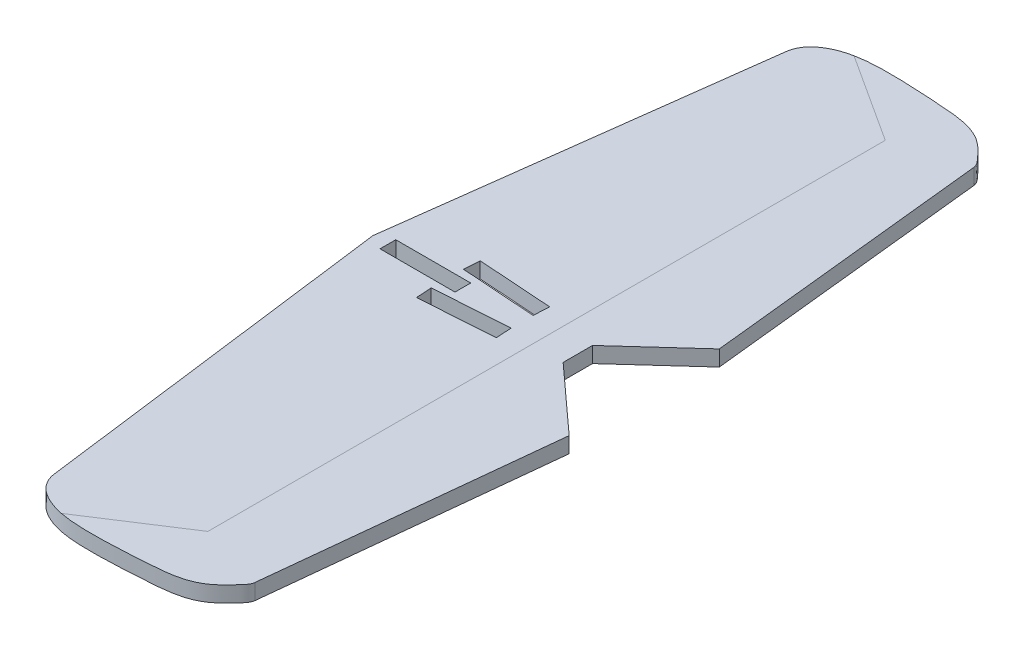
ISO-10303-21;
HEADER;
FILE_DESCRIPTION(('STEP AP214'),'2;1');
FILE_NAME('part.step','',(''),(''),'','','');
FILE_SCHEMA(('AUTOMOTIVE_DESIGN { 1 0 10303 214 1 1 1 1 }'));
ENDSEC;
DATA;
#1=APPLICATION_CONTEXT('core data for automotive mechanical design processes');
#2=APPLICATION_PROTOCOL_DEFINITION('international standard','automotive_design',2000,#1);
#3=PRODUCT_CONTEXT('',#1,'mechanical');
#4=PRODUCT('Part','Part','',(#3));
#5=PRODUCT_RELATED_PRODUCT_CATEGORY('part','',(#4));
#6=PRODUCT_DEFINITION_FORMATION('','',#4);
#7=PRODUCT_DEFINITION_CONTEXT('part definition',#1,'design');
#8=PRODUCT_DEFINITION('design','',#6,#7);
#9=PRODUCT_DEFINITION_SHAPE('','',#8);
#10=(LENGTH_UNIT() NAMED_UNIT(*) SI_UNIT(.MILLI.,.METRE.));
#11=(NAMED_UNIT(*) PLANE_ANGLE_UNIT() SI_UNIT($,.RADIAN.));
#12=(NAMED_UNIT(*) SI_UNIT($,.STERADIAN.) SOLID_ANGLE_UNIT());
#13=UNCERTAINTY_MEASURE_WITH_UNIT(LENGTH_MEASURE(1.E-05),#10,'distance_accuracy_value','');
#14=(GEOMETRIC_REPRESENTATION_CONTEXT(3) GLOBAL_UNCERTAINTY_ASSIGNED_CONTEXT((#13)) GLOBAL_UNIT_ASSIGNED_CONTEXT((#10,
#11,#12)) REPRESENTATION_CONTEXT('',''));
#15=CARTESIAN_POINT('',(0.,0.,0.));
#16=DIRECTION('',(0.,0.,1.));
#17=DIRECTION('',(1.,0.,0.));
#18=AXIS2_PLACEMENT_3D('',#15,#16,#17);
#19=CARTESIAN_POINT('',(0.,5.334,0.));
#20=DIRECTION('',(0.,1.,0.));
#21=DIRECTION('',(0.,0.,1.));
#22=AXIS2_PLACEMENT_3D('',#19,#20,#21);
#23=PLANE('',#22);
#24=DIRECTION('',(0.,0.,-1.));
#25=VECTOR('',#24,1.);
#26=CARTESIAN_POINT('',(30.48,5.334,2.667));
#27=LINE('',#26,#25);
#28=CARTESIAN_POINT('',(30.48,5.334,2.667));
#29=VERTEX_POINT('',#28);
#30=CARTESIAN_POINT('',(30.48,5.334,-2.667));
#31=VERTEX_POINT('',#30);
#32=EDGE_CURVE('E55',#29,#31,#27,.T.);
#33=ORIENTED_EDGE('',*,*,#32,.F.);
#34=DIRECTION('',(1.,0.,0.));
#35=VECTOR('',#34,1.);
#36=CARTESIAN_POINT('',(5.08,5.334,2.667));
#37=LINE('',#36,#35);
#38=CARTESIAN_POINT('',(5.08,5.334,2.667));
#39=VERTEX_POINT('',#38);
#40=EDGE_CURVE('E202',#39,#29,#37,.T.);
#41=ORIENTED_EDGE('',*,*,#40,.F.);
#42=DIRECTION('',(0.,0.,1.));
#43=VECTOR('',#42,1.);
#44=CARTESIAN_POINT('',(5.08,5.334,2.667));
#45=LINE('',#44,#43);
#46=CARTESIAN_POINT('',(5.08,5.334,-2.667));
#47=VERTEX_POINT('',#46);
#48=EDGE_CURVE('E222',#47,#39,#45,.T.);
#49=ORIENTED_EDGE('',*,*,#48,.F.);
#50=DIRECTION('',(-1.,0.,0.));
#51=VECTOR('',#50,1.);
#52=CARTESIAN_POINT('',(5.08,5.334,-2.667));
#53=LINE('',#52,#51);
#54=EDGE_CURVE('E216',#31,#47,#53,.T.);
#55=ORIENTED_EDGE('',*,*,#54,.F.);
#56=EDGE_LOOP('',(#33,#41,#49,#55));
#57=FACE_BOUND('',#56,.T.);
#58=DIRECTION('',(0.0687869822485303,0.,0.997631370333321));
#59=VECTOR('',#58,1.);
#60=CARTESIAN_POINT('',(25.2047798613313,5.334,5.47048980785622));
#61=LINE('',#60,#59);
#62=CARTESIAN_POINT('',(25.2047798613313,5.334,5.47048980785622));
#63=VERTEX_POINT('',#62);
#64=CARTESIAN_POINT('',(25.571689624645,5.334,10.7918555372142));
#65=VERTEX_POINT('',#64);
#66=EDGE_CURVE('E238',#63,#65,#61,.T.);
#67=ORIENTED_EDGE('',*,*,#66,.F.);
#68=DIRECTION('',(-0.997631370333322,0.,0.0687869822485204));
#69=VECTOR('',#68,1.);
#70=CARTESIAN_POINT('',(50.5446166677977,5.334,3.7233004587438));
#71=LINE('',#70,#69);
#72=CARTESIAN_POINT('',(50.5446166677977,5.334,3.7233004587438));
#73=VERTEX_POINT('',#72);
#74=EDGE_CURVE('E246',#73,#63,#71,.T.);
#75=ORIENTED_EDGE('',*,*,#74,.F.);
#76=DIRECTION('',(-0.0687869822485303,0.,-0.997631370333321));
#77=VECTOR('',#76,1.);
#78=CARTESIAN_POINT('',(50.9115264311114,5.334,9.04466618810174));
#79=LINE('',#78,#77);
#80=CARTESIAN_POINT('',(50.9115264311114,5.334,9.04466618810174));
#81=VERTEX_POINT('',#80);
#82=EDGE_CURVE('E243',#81,#73,#79,.T.);
#83=ORIENTED_EDGE('',*,*,#82,.F.);
#84=DIRECTION('',(0.997631370333322,0.,-0.0687869822485205));
#85=VECTOR('',#84,1.);
#86=CARTESIAN_POINT('',(25.571689624645,5.334,10.7918555372142));
#87=LINE('',#86,#85);
#88=EDGE_CURVE('E240',#65,#81,#87,.T.);
#89=ORIENTED_EDGE('',*,*,#88,.F.);
#90=EDGE_LOOP('',(#67,#75,#83,#89));
#91=FACE_BOUND('',#90,.T.);
#92=DIRECTION('',(0.0687869822485303,0.,-0.997631370333321));
#93=VECTOR('',#92,1.);
#94=CARTESIAN_POINT('',(50.5446166677977,5.334,-3.72330045874381));
#95=LINE('',#94,#93);
#96=CARTESIAN_POINT('',(50.5446166677977,5.334,-3.72330045874381));
#97=VERTEX_POINT('',#96);
#98=CARTESIAN_POINT('',(50.9115264311114,5.334,-9.04466618810174));
#99=VERTEX_POINT('',#98);
#100=EDGE_CURVE('E269',#97,#99,#95,.T.);
#101=ORIENTED_EDGE('',*,*,#100,.F.);
#102=DIRECTION('',(0.997631370333322,0.,0.0687869822485204));
#103=VECTOR('',#102,1.);
#104=CARTESIAN_POINT('',(25.2047798613313,5.334,-5.47048980785623));
#105=LINE('',#104,#103);
#106=CARTESIAN_POINT('',(25.2047798613313,5.334,-5.47048980785623));
#107=VERTEX_POINT('',#106);
#108=EDGE_CURVE('E277',#107,#97,#105,.T.);
#109=ORIENTED_EDGE('',*,*,#108,.F.);
#110=DIRECTION('',(-0.0687869822485303,0.,0.997631370333321));
#111=VECTOR('',#110,1.);
#112=CARTESIAN_POINT('',(25.571689624645,5.334,-10.7918555372142));
#113=LINE('',#112,#111);
#114=CARTESIAN_POINT('',(25.571689624645,5.334,-10.7918555372142));
#115=VERTEX_POINT('',#114);
#116=EDGE_CURVE('E274',#115,#107,#113,.T.);
#117=ORIENTED_EDGE('',*,*,#116,.F.);
#118=DIRECTION('',(-0.997631370333322,0.,-0.0687869822485204));
#119=VECTOR('',#118,1.);
#120=CARTESIAN_POINT('',(50.9115264311114,5.334,-9.04466618810174));
#121=LINE('',#120,#119);
#122=EDGE_CURVE('E271',#99,#115,#121,.T.);
#123=ORIENTED_EDGE('',*,*,#122,.F.);
#124=EDGE_LOOP('',(#101,#109,#117,#123));
#125=FACE_BOUND('',#124,.T.);
#126=DIRECTION('',(0.,0.,-1.));
#127=VECTOR('',#126,1.);
#128=CARTESIAN_POINT('',(58.8561371925111,5.334,0.));
#129=LINE('',#128,#127);
#130=CARTESIAN_POINT('',(58.8561371925111,5.334,114.78665798769));
#131=VERTEX_POINT('',#130);
#132=CARTESIAN_POINT('',(58.8561371925111,5.334,-114.78665798769));
#133=VERTEX_POINT('',#132);
#134=EDGE_CURVE('E48',#131,#133,#129,.T.);
#135=ORIENTED_EDGE('',*,*,#134,.T.);
#136=DIRECTION('',(-0.83910232786527,0.,-0.543973605399274));
#137=VECTOR('',#136,1.);
#138=CARTESIAN_POINT('',(69.8102744451348,5.334,-107.685305342766));
#139=LINE('',#138,#137);
#140=CARTESIAN_POINT('',(28.7278859954556,5.334,-134.318213179973));
#141=VERTEX_POINT('',#140);
#142=EDGE_CURVE('E11',#133,#141,#139,.T.);
#143=ORIENTED_EDGE('',*,*,#142,.T.);
#144=CARTESIAN_POINT('',(15.9702164979944,5.334,-123.888067637132));
#145=CARTESIAN_POINT('',(16.4963487927457,5.334,-127.969509696882));
#146=CARTESIAN_POINT('',(23.1266573834124,5.334,-134.082989783868));
#147=CARTESIAN_POINT('',(33.9982040420756,5.334,-135.216803509659));
#148=CARTESIAN_POINT('',(46.0547082745857,5.334,-135.14509413231));
#149=CARTESIAN_POINT('',(57.8788575886376,5.334,-134.457454778396));
#150=CARTESIAN_POINT('',(71.9865891268067,5.334,-133.257487145702));
#151=CARTESIAN_POINT('',(78.6192928755792,5.334,-126.558567530121));
#152=CARTESIAN_POINT('',(81.6818469453373,5.334,-123.009151118355));
#153=CARTESIAN_POINT('',(81.8050974666888,5.334,-121.838331349505));
#154=B_SPLINE_CURVE_WITH_KNOTS('',3,(#144,#145,#146,#147,#148,#149,#150,#151,#152,#153),
.UNSPECIFIED.,.F.,.F.,(4,1,1,1,1,1,1,4),(0.,0.137873604608299,0.340707260866682,
0.419473128803028,0.623495843735745,0.825009794656915,0.952423895278866,1.),.UNSPECIFIED.);
#155=CARTESIAN_POINT('',(15.9702164979944,5.334,-123.888067637132));
#156=VERTEX_POINT('',#155);
#157=EDGE_CURVE('E316',#156,#141,#154,.T.);
#158=ORIENTED_EDGE('',*,*,#157,.F.);
#159=DIRECTION('',(0.127850537666377,0.,-0.991793446246958));
#160=VECTOR('',#159,1.);
#161=CARTESIAN_POINT('',(0.,5.334,0.));
#162=LINE('',#161,#160);
#163=CARTESIAN_POINT('',(0.,5.334,0.));
#164=VERTEX_POINT('',#163);
#165=EDGE_CURVE('E322',#164,#156,#162,.T.);
#166=ORIENTED_EDGE('',*,*,#165,.F.);
#167=DIRECTION('',(0.127850537666377,0.,0.991793446246958));
#168=VECTOR('',#167,1.);
#169=CARTESIAN_POINT('',(0.,5.334,0.));
#170=LINE('',#169,#168);
#171=CARTESIAN_POINT('',(15.9702164979944,5.334,123.888067637132));
#172=VERTEX_POINT('',#171);
#173=EDGE_CURVE('E409',#164,#172,#170,.T.);
#174=ORIENTED_EDGE('',*,*,#173,.T.);
#175=CARTESIAN_POINT('',(15.9702164979944,5.334,123.888067637132));
#176=CARTESIAN_POINT('',(16.4963487927457,5.334,127.969509696882));
#177=CARTESIAN_POINT('',(23.1266573834124,5.334,134.082989783868));
#178=CARTESIAN_POINT('',(33.9982040420756,5.334,135.216803509659));
#179=CARTESIAN_POINT('',(46.0547082745857,5.334,135.14509413231));
#180=CARTESIAN_POINT('',(57.8788575886376,5.334,134.457454778396));
#181=CARTESIAN_POINT('',(71.9865891268067,5.334,133.257487145702));
#182=CARTESIAN_POINT('',(78.6192928755792,5.334,126.558567530121));
#183=CARTESIAN_POINT('',(81.6818469453373,5.334,123.009151118355));
#184=CARTESIAN_POINT('',(81.8050974666888,5.334,121.838331349505));
#185=B_SPLINE_CURVE_WITH_KNOTS('',3,(#175,#176,#177,#178,#179,#180,#181,#182,#183,#184),
.UNSPECIFIED.,.F.,.F.,(4,1,1,1,1,1,1,4),(0.,0.137873604608299,0.340707260866682,
0.419473128803028,0.623495843735745,0.825009794656915,0.952423895278866,1.),.UNSPECIFIED.);
#186=CARTESIAN_POINT('',(28.7278859954557,5.334,134.318213179973));
#187=VERTEX_POINT('',#186);
#188=EDGE_CURVE('E292',#172,#187,#185,.T.);
#189=ORIENTED_EDGE('',*,*,#188,.T.);
#190=DIRECTION('',(0.83910232786527,0.,-0.543973605399274));
#191=VECTOR('',#190,1.);
#192=CARTESIAN_POINT('',(69.8102744451348,5.334,107.685305342766));
#193=LINE('',#192,#191);
#194=EDGE_CURVE('E381',#187,#131,#193,.T.);
#195=ORIENTED_EDGE('',*,*,#194,.T.);
#196=EDGE_LOOP('',(#135,#143,#158,#166,#174,#189,#195));
#197=FACE_BOUND('',#196,.T.);
#198=ADVANCED_FACE('F38',(#57,#91,#125,#197),#23,.T.);
#199=DIRECTION('',(0.,-1.,0.));
#200=VECTOR('',#199,1.);
#201=SURFACE_OF_LINEAR_EXTRUSION('',#185,#200);
#202=CARTESIAN_POINT('',(15.9702164979944,0.,123.888067637132));
#203=CARTESIAN_POINT('',(16.4963487927457,0.,127.969509696882));
#204=CARTESIAN_POINT('',(23.1266573834124,0.,134.082989783868));
#205=CARTESIAN_POINT('',(33.9982040420756,0.,135.216803509659));
#206=CARTESIAN_POINT('',(46.0547082745857,0.,135.14509413231));
#207=CARTESIAN_POINT('',(57.8788575886376,0.,134.457454778396));
#208=CARTESIAN_POINT('',(71.9865891268067,0.,133.257487145702));
#209=CARTESIAN_POINT('',(78.6192928755792,0.,126.558567530121));
#210=CARTESIAN_POINT('',(81.6818469453373,0.,123.009151118355));
#211=CARTESIAN_POINT('',(81.8050974666888,0.,121.838331349505));
#212=B_SPLINE_CURVE_WITH_KNOTS('',3,(#202,#203,#204,#205,#206,#207,#208,#209,#210,#211),
.UNSPECIFIED.,.F.,.F.,(4,1,1,1,1,1,1,4),(0.,0.137873604608299,0.340707260866682,
0.419473128803028,0.623495843735745,0.825009794656915,0.952423895278866,1.),.UNSPECIFIED.);
#213=CARTESIAN_POINT('',(15.9702164979944,0.,123.888067637132));
#214=VERTEX_POINT('',#213);
#215=CARTESIAN_POINT('',(81.8050974666888,0.,121.838331349505));
#216=VERTEX_POINT('',#215);
#217=EDGE_CURVE('E291',#214,#216,#212,.T.);
#218=ORIENTED_EDGE('',*,*,#217,.T.);
#219=DIRECTION('',(0.,-1.,0.));
#220=VECTOR('',#219,1.);
#221=CARTESIAN_POINT('',(81.8050974666888,5.334,121.838331349505));
#222=LINE('',#221,#220);
#223=CARTESIAN_POINT('',(81.8050974666888,5.334,121.838331349505));
#224=VERTEX_POINT('',#223);
#225=EDGE_CURVE('E386',#224,#216,#222,.T.);
#226=ORIENTED_EDGE('',*,*,#225,.F.);
#227=EDGE_CURVE('E299',#187,#224,#185,.T.);
#228=ORIENTED_EDGE('',*,*,#227,.F.);
#229=ORIENTED_EDGE('',*,*,#188,.F.);
#230=DIRECTION('',(0.,-1.,0.));
#231=VECTOR('',#230,1.);
#232=CARTESIAN_POINT('',(15.9702164979944,5.334,123.888067637132));
#233=LINE('',#232,#231);
#234=EDGE_CURVE('E406',#172,#214,#233,.T.);
#235=ORIENTED_EDGE('',*,*,#234,.T.);
#236=EDGE_LOOP('',(#218,#226,#228,#229,#235));
#237=FACE_BOUND('',#236,.T.);
#238=ADVANCED_FACE('F40',(#237),#201,.F.);
#239=CARTESIAN_POINT('',(93.5936884313565,5.334,9.85247362684192));
#240=DIRECTION('',(-0.994504892678948,0.,-0.104690106684607));
#241=DIRECTION('',(-0.104690106684607,0.,0.994504892678948));
#242=AXIS2_PLACEMENT_3D('',#239,#240,#241);
#243=PLANE('',#242);
#244=DIRECTION('',(0.104690106684607,0.,-0.994504892678948));
#245=VECTOR('',#244,1.);
#246=CARTESIAN_POINT('',(93.5936884313565,0.,9.85247362684192));
#247=LINE('',#246,#245);
#248=CARTESIAN_POINT('',(91.9525715057503,0.,25.4422830525839));
#249=VERTEX_POINT('',#248);
#250=EDGE_CURVE('E435',#216,#249,#247,.T.);
#251=ORIENTED_EDGE('',*,*,#250,.T.);
#252=DIRECTION('',(0.,-1.,0.));
#253=VECTOR('',#252,1.);
#254=CARTESIAN_POINT('',(91.9525715057503,5.334,25.4422830525839));
#255=LINE('',#254,#253);
#256=CARTESIAN_POINT('',(91.9525715057503,5.334,25.4422830525839));
#257=VERTEX_POINT('',#256);
#258=EDGE_CURVE('E391',#257,#249,#255,.T.);
#259=ORIENTED_EDGE('',*,*,#258,.F.);
#260=DIRECTION('',(0.104690106684607,0.,-0.994504892678948));
#261=VECTOR('',#260,1.);
#262=CARTESIAN_POINT('',(93.5936884313565,5.334,9.85247362684192));
#263=LINE('',#262,#261);
#264=EDGE_CURVE('E298',#224,#257,#263,.T.);
#265=ORIENTED_EDGE('',*,*,#264,.F.);
#266=ORIENTED_EDGE('',*,*,#225,.T.);
#267=EDGE_LOOP('',(#251,#259,#265,#266));
#268=FACE_BOUND('',#267,.T.);
#269=ADVANCED_FACE('F349',(#268),#243,.F.);
#270=CARTESIAN_POINT('',(28.9439186189584,5.334,-31.8383104808575));
#271=DIRECTION('',(-0.672672793996275,0.,0.739940073395978));
#272=DIRECTION('',(0.739940073395978,0.,0.672672793996275));
#273=AXIS2_PLACEMENT_3D('',#270,#271,#272);
#274=PLANE('',#273);
#275=DIRECTION('',(-0.739940073395978,0.,-0.672672793996275));
#276=VECTOR('',#275,1.);
#277=CARTESIAN_POINT('',(28.9439186189584,0.,-31.8383104808575));
#278=LINE('',#277,#276);
#279=CARTESIAN_POINT('',(69.4478620140546,0.,4.98345624195347));
#280=VERTEX_POINT('',#279);
#281=EDGE_CURVE('E432',#249,#280,#278,.T.);
#282=ORIENTED_EDGE('',*,*,#281,.T.);
#283=DIRECTION('',(0.,-1.,0.));
#284=VECTOR('',#283,1.);
#285=CARTESIAN_POINT('',(69.4478620140546,5.334,4.98345624195347));
#286=LINE('',#285,#284);
#287=CARTESIAN_POINT('',(69.4478620140546,5.334,4.98345624195347));
#288=VERTEX_POINT('',#287);
#289=EDGE_CURVE('E394',#288,#280,#286,.T.);
#290=ORIENTED_EDGE('',*,*,#289,.F.);
#291=DIRECTION('',(-0.739940073395978,0.,-0.672672793996275));
#292=VECTOR('',#291,1.);
#293=CARTESIAN_POINT('',(28.9439186189584,5.334,-31.8383104808575));
#294=LINE('',#293,#292);
#295=EDGE_CURVE('E304',#257,#288,#294,.T.);
#296=ORIENTED_EDGE('',*,*,#295,.F.);
#297=ORIENTED_EDGE('',*,*,#258,.T.);
#298=EDGE_LOOP('',(#282,#290,#296,#297));
#299=FACE_BOUND('',#298,.T.);
#300=ADVANCED_FACE('F346',(#299),#274,.F.);
#301=CARTESIAN_POINT('',(69.4478620140559,5.334,1.9436342152399E-11));
#302=DIRECTION('',(1.,0.,2.79869553773523E-13));
#303=DIRECTION('',(2.79869553773523E-13,0.,-1.));
#304=AXIS2_PLACEMENT_3D('',#301,#302,#303);
#305=PLANE('',#304);
#306=DIRECTION('',(-2.79869553773523E-13,0.,1.));
#307=VECTOR('',#306,1.);
#308=CARTESIAN_POINT('',(69.4478620140559,0.,1.9436342152399E-11));
#309=LINE('',#308,#307);
#310=CARTESIAN_POINT('',(69.4478620140573,0.,-4.98345624195318));
#311=VERTEX_POINT('',#310);
#312=EDGE_CURVE('E429',#311,#280,#309,.T.);
#313=ORIENTED_EDGE('',*,*,#312,.F.);
#314=DIRECTION('',(0.,-1.,0.));
#315=VECTOR('',#314,1.);
#316=CARTESIAN_POINT('',(69.4478620140573,5.334,-4.98345624195318));
#317=LINE('',#316,#315);
#318=CARTESIAN_POINT('',(69.4478620140573,5.334,-4.98345624195318));
#319=VERTEX_POINT('',#318);
#320=EDGE_CURVE('E396',#319,#311,#317,.T.);
#321=ORIENTED_EDGE('',*,*,#320,.F.);
#322=DIRECTION('',(-2.79869553773523E-13,0.,1.));
#323=VECTOR('',#322,1.);
#324=CARTESIAN_POINT('',(69.4478620140559,5.334,1.9436342152399E-11));
#325=LINE('',#324,#323);
#326=EDGE_CURVE('E306',#319,#288,#325,.T.);
#327=ORIENTED_EDGE('',*,*,#326,.T.);
#328=ORIENTED_EDGE('',*,*,#289,.T.);
#329=EDGE_LOOP('',(#313,#321,#327,#328));
#330=FACE_BOUND('',#329,.T.);
#331=ADVANCED_FACE('F342',(#330),#305,.T.);
#332=CARTESIAN_POINT('',(28.9439186189614,5.334,31.8383104808593));
#333=DIRECTION('',(0.672672793996293,0.,0.739940073395962));
#334=DIRECTION('',(0.739940073395962,0.,-0.672672793996293));
#335=AXIS2_PLACEMENT_3D('',#332,#333,#334);
#336=PLANE('',#335);
#337=DIRECTION('',(-0.739940073395962,0.,0.672672793996293));
#338=VECTOR('',#337,1.);
#339=CARTESIAN_POINT('',(28.9439186189614,0.,31.8383104808593));
#340=LINE('',#339,#338);
#341=CARTESIAN_POINT('',(91.9525715057526,0.,-25.4422830525841));
#342=VERTEX_POINT('',#341);
#343=EDGE_CURVE('E426',#342,#311,#340,.T.);
#344=ORIENTED_EDGE('',*,*,#343,.F.);
#345=DIRECTION('',(0.,-1.,0.));
#346=VECTOR('',#345,1.);
#347=CARTESIAN_POINT('',(91.9525715057526,5.334,-25.4422830525841));
#348=LINE('',#347,#346);
#349=CARTESIAN_POINT('',(91.9525715057526,5.334,-25.4422830525841));
#350=VERTEX_POINT('',#349);
#351=EDGE_CURVE('E398',#350,#342,#348,.T.);
#352=ORIENTED_EDGE('',*,*,#351,.F.);
#353=DIRECTION('',(-0.739940073395962,0.,0.672672793996293));
#354=VECTOR('',#353,1.);
#355=CARTESIAN_POINT('',(28.9439186189614,5.334,31.8383104808593));
#356=LINE('',#355,#354);
#357=EDGE_CURVE('E309',#350,#319,#356,.T.);
#358=ORIENTED_EDGE('',*,*,#357,.T.);
#359=ORIENTED_EDGE('',*,*,#320,.T.);
#360=EDGE_LOOP('',(#344,#352,#358,#359));
#361=FACE_BOUND('',#360,.T.);
#362=ADVANCED_FACE('F338',(#361),#336,.T.);
#363=CARTESIAN_POINT('',(93.5936884313589,5.334,-9.85247362684443));
#364=DIRECTION('',(0.994504892678945,0.,-0.104690106684631));
#365=DIRECTION('',(-0.104690106684631,0.,-0.994504892678945));
#366=AXIS2_PLACEMENT_3D('',#363,#364,#365);
#367=PLANE('',#366);
#368=DIRECTION('',(0.104690106684631,0.,0.994504892678945));
#369=VECTOR('',#368,1.);
#370=CARTESIAN_POINT('',(93.5936884313589,0.,-9.85247362684443));
#371=LINE('',#370,#369);
#372=CARTESIAN_POINT('',(81.8050974666888,0.,-121.838331349505));
#373=VERTEX_POINT('',#372);
#374=EDGE_CURVE('E420',#373,#342,#371,.T.);
#375=ORIENTED_EDGE('',*,*,#374,.F.);
#376=DIRECTION('',(0.,-1.,0.));
#377=VECTOR('',#376,1.);
#378=CARTESIAN_POINT('',(81.8050974666888,5.334,-121.838331349505));
#379=LINE('',#378,#377);
#380=CARTESIAN_POINT('',(81.8050974666888,5.334,-121.838331349505));
#381=VERTEX_POINT('',#380);
#382=EDGE_CURVE('E400',#381,#373,#379,.T.);
#383=ORIENTED_EDGE('',*,*,#382,.F.);
#384=DIRECTION('',(0.104690106684631,0.,0.994504892678945));
#385=VECTOR('',#384,1.);
#386=CARTESIAN_POINT('',(93.5936884313589,5.334,-9.85247362684443));
#387=LINE('',#386,#385);
#388=EDGE_CURVE('E312',#381,#350,#387,.T.);
#389=ORIENTED_EDGE('',*,*,#388,.T.);
#390=ORIENTED_EDGE('',*,*,#351,.T.);
#391=EDGE_LOOP('',(#375,#383,#389,#390));
#392=FACE_BOUND('',#391,.T.);
#393=ADVANCED_FACE('F333',(#392),#367,.T.);
#394=DIRECTION('',(0.,-1.,0.));
#395=VECTOR('',#394,1.);
#396=SURFACE_OF_LINEAR_EXTRUSION('',#154,#395);
#397=CARTESIAN_POINT('',(15.9702164979944,0.,-123.888067637132));
#398=CARTESIAN_POINT('',(16.4963487927457,0.,-127.969509696882));
#399=CARTESIAN_POINT('',(23.1266573834124,0.,-134.082989783868));
#400=CARTESIAN_POINT('',(33.9982040420756,0.,-135.216803509659));
#401=CARTESIAN_POINT('',(46.0547082745857,0.,-135.14509413231));
#402=CARTESIAN_POINT('',(57.8788575886376,0.,-134.457454778396));
#403=CARTESIAN_POINT('',(71.9865891268067,0.,-133.257487145702));
#404=CARTESIAN_POINT('',(78.6192928755792,0.,-126.558567530121));
#405=CARTESIAN_POINT('',(81.6818469453373,0.,-123.009151118355));
#406=CARTESIAN_POINT('',(81.8050974666888,0.,-121.838331349505));
#407=B_SPLINE_CURVE_WITH_KNOTS('',3,(#397,#398,#399,#400,#401,#402,#403,#404,#405,#406),
.UNSPECIFIED.,.F.,.F.,(4,1,1,1,1,1,1,4),(0.,0.137873604608299,0.340707260866682,
0.419473128803028,0.623495843735745,0.825009794656915,0.952423895278866,1.),.UNSPECIFIED.);
#408=CARTESIAN_POINT('',(15.9702164979944,0.,-123.888067637132));
#409=VERTEX_POINT('',#408);
#410=EDGE_CURVE('E415',#409,#373,#407,.T.);
#411=ORIENTED_EDGE('',*,*,#410,.F.);
#412=DIRECTION('',(0.,-1.,0.));
#413=VECTOR('',#412,1.);
#414=CARTESIAN_POINT('',(15.9702164979944,5.334,-123.888067637132));
#415=LINE('',#414,#413);
#416=EDGE_CURVE('E402',#156,#409,#415,.T.);
#417=ORIENTED_EDGE('',*,*,#416,.F.);
#418=ORIENTED_EDGE('',*,*,#157,.T.);
#419=EDGE_CURVE('E315',#141,#381,#154,.T.);
#420=ORIENTED_EDGE('',*,*,#419,.T.);
#421=ORIENTED_EDGE('',*,*,#382,.T.);
#422=EDGE_LOOP('',(#411,#417,#418,#420,#421));
#423=FACE_BOUND('',#422,.T.);
#424=ADVANCED_FACE('F328',(#423),#396,.T.);
#425=CARTESIAN_POINT('',(0.,5.334,0.));
#426=DIRECTION('',(-0.991793446246958,0.,-0.127850537666377));
#427=DIRECTION('',(-0.127850537666377,0.,0.991793446246958));
#428=AXIS2_PLACEMENT_3D('',#425,#426,#427);
#429=PLANE('',#428);
#430=DIRECTION('',(0.127850537666377,0.,-0.991793446246958));
#431=VECTOR('',#430,1.);
#432=CARTESIAN_POINT('',(0.,0.,0.));
#433=LINE('',#432,#431);
#434=CARTESIAN_POINT('',(0.,0.,0.));
#435=VERTEX_POINT('',#434);
#436=EDGE_CURVE('E412',#435,#409,#433,.T.);
#437=ORIENTED_EDGE('',*,*,#436,.F.);
#438=DIRECTION('',(0.,-1.,0.));
#439=VECTOR('',#438,1.);
#440=CARTESIAN_POINT('',(0.,5.334,0.));
#441=LINE('',#440,#439);
#442=EDGE_CURVE('E404',#164,#435,#441,.T.);
#443=ORIENTED_EDGE('',*,*,#442,.F.);
#444=ORIENTED_EDGE('',*,*,#165,.T.);
#445=ORIENTED_EDGE('',*,*,#416,.T.);
#446=EDGE_LOOP('',(#437,#443,#444,#445));
#447=FACE_BOUND('',#446,.T.);
#448=ADVANCED_FACE('F332',(#447),#429,.T.);
#449=CARTESIAN_POINT('',(0.,5.334,0.));
#450=DIRECTION('',(0.991793446246958,0.,-0.127850537666377));
#451=DIRECTION('',(-0.127850537666377,0.,-0.991793446246958));
#452=AXIS2_PLACEMENT_3D('',#449,#450,#451);
#453=PLANE('',#452);
#454=DIRECTION('',(0.127850537666377,0.,0.991793446246958));
#455=VECTOR('',#454,1.);
#456=CARTESIAN_POINT('',(0.,0.,0.));
#457=LINE('',#456,#455);
#458=EDGE_CURVE('E410',#435,#214,#457,.T.);
#459=ORIENTED_EDGE('',*,*,#458,.T.);
#460=ORIENTED_EDGE('',*,*,#234,.F.);
#461=ORIENTED_EDGE('',*,*,#173,.F.);
#462=ORIENTED_EDGE('',*,*,#442,.T.);
#463=EDGE_LOOP('',(#459,#460,#461,#462));
#464=FACE_BOUND('',#463,.T.);
#465=ADVANCED_FACE('F367',(#464),#453,.F.);
#466=ORIENTED_EDGE('',*,*,#142,.F.);
#467=ORIENTED_EDGE('',*,*,#134,.F.);
#468=ORIENTED_EDGE('',*,*,#194,.F.);
#469=ORIENTED_EDGE('',*,*,#227,.T.);
#470=ORIENTED_EDGE('',*,*,#264,.T.);
#471=ORIENTED_EDGE('',*,*,#295,.T.);
#472=ORIENTED_EDGE('',*,*,#326,.F.);
#473=ORIENTED_EDGE('',*,*,#357,.F.);
#474=ORIENTED_EDGE('',*,*,#388,.F.);
#475=ORIENTED_EDGE('',*,*,#419,.F.);
#476=EDGE_LOOP('',(#466,#467,#468,#469,#470,#471,#472,#473,#474,#475));
#477=FACE_BOUND('',#476,.T.);
#478=ADVANCED_FACE('F360',(#477),#23,.T.);
#479=CARTESIAN_POINT('',(0.,0.,0.));
#480=DIRECTION('',(0.,1.,0.));
#481=DIRECTION('',(0.,0.,1.));
#482=AXIS2_PLACEMENT_3D('',#479,#480,#481);
#483=PLANE('',#482);
#484=DIRECTION('',(-1.,0.,0.));
#485=VECTOR('',#484,1.);
#486=CARTESIAN_POINT('',(5.08,0.,2.667));
#487=LINE('',#486,#485);
#488=CARTESIAN_POINT('',(30.48,0.,2.667));
#489=VERTEX_POINT('',#488);
#490=CARTESIAN_POINT('',(5.08,0.,2.667));
#491=VERTEX_POINT('',#490);
#492=EDGE_CURVE('E214',#489,#491,#487,.T.);
#493=ORIENTED_EDGE('',*,*,#492,.F.);
#494=DIRECTION('',(0.,0.,1.));
#495=VECTOR('',#494,1.);
#496=CARTESIAN_POINT('',(30.48,0.,2.667));
#497=LINE('',#496,#495);
#498=CARTESIAN_POINT('',(30.48,0.,-2.667));
#499=VERTEX_POINT('',#498);
#500=EDGE_CURVE('E196',#499,#489,#497,.T.);
#501=ORIENTED_EDGE('',*,*,#500,.F.);
#502=DIRECTION('',(1.,0.,0.));
#503=VECTOR('',#502,1.);
#504=CARTESIAN_POINT('',(5.08,0.,-2.667));
#505=LINE('',#504,#503);
#506=CARTESIAN_POINT('',(5.08,0.,-2.667));
#507=VERTEX_POINT('',#506);
#508=EDGE_CURVE('E205',#507,#499,#505,.T.);
#509=ORIENTED_EDGE('',*,*,#508,.F.);
#510=DIRECTION('',(0.,0.,-1.));
#511=VECTOR('',#510,1.);
#512=CARTESIAN_POINT('',(5.08,0.,2.667));
#513=LINE('',#512,#511);
#514=EDGE_CURVE('E63',#491,#507,#513,.T.);
#515=ORIENTED_EDGE('',*,*,#514,.F.);
#516=EDGE_LOOP('',(#493,#501,#509,#515));
#517=FACE_BOUND('',#516,.T.);
#518=DIRECTION('',(0.997631370333322,0.,-0.0687869822485204));
#519=VECTOR('',#518,1.);
#520=CARTESIAN_POINT('',(50.5446166677977,0.,3.7233004587438));
#521=LINE('',#520,#519);
#522=CARTESIAN_POINT('',(25.2047798613313,0.,5.47048980785622));
#523=VERTEX_POINT('',#522);
#524=CARTESIAN_POINT('',(50.5446166677977,0.,3.7233004587438));
#525=VERTEX_POINT('',#524);
#526=EDGE_CURVE('E232',#523,#525,#521,.T.);
#527=ORIENTED_EDGE('',*,*,#526,.F.);
#528=DIRECTION('',(-0.0687869822485303,0.,-0.997631370333321));
#529=VECTOR('',#528,1.);
#530=CARTESIAN_POINT('',(25.2047798613313,0.,5.47048980785622));
#531=LINE('',#530,#529);
#532=CARTESIAN_POINT('',(25.571689624645,0.,10.7918555372142));
#533=VERTEX_POINT('',#532);
#534=EDGE_CURVE('E235',#533,#523,#531,.T.);
#535=ORIENTED_EDGE('',*,*,#534,.F.);
#536=DIRECTION('',(-0.997631370333322,0.,0.0687869822485205));
#537=VECTOR('',#536,1.);
#538=CARTESIAN_POINT('',(25.571689624645,0.,10.7918555372142));
#539=LINE('',#538,#537);
#540=CARTESIAN_POINT('',(50.9115264311114,0.,9.04466618810174));
#541=VERTEX_POINT('',#540);
#542=EDGE_CURVE('E252',#541,#533,#539,.T.);
#543=ORIENTED_EDGE('',*,*,#542,.F.);
#544=DIRECTION('',(0.0687869822485303,0.,0.997631370333321));
#545=VECTOR('',#544,1.);
#546=CARTESIAN_POINT('',(50.9115264311114,0.,9.04466618810174));
#547=LINE('',#546,#545);
#548=EDGE_CURVE('E208',#525,#541,#547,.T.);
#549=ORIENTED_EDGE('',*,*,#548,.F.);
#550=EDGE_LOOP('',(#527,#535,#543,#549));
#551=FACE_BOUND('',#550,.T.);
#552=DIRECTION('',(-0.997631370333322,0.,-0.0687869822485204));
#553=VECTOR('',#552,1.);
#554=CARTESIAN_POINT('',(25.2047798613313,0.,-5.47048980785623));
#555=LINE('',#554,#553);
#556=CARTESIAN_POINT('',(50.5446166677977,0.,-3.72330045874381));
#557=VERTEX_POINT('',#556);
#558=CARTESIAN_POINT('',(25.2047798613313,0.,-5.47048980785623));
#559=VERTEX_POINT('',#558);
#560=EDGE_CURVE('E263',#557,#559,#555,.T.);
#561=ORIENTED_EDGE('',*,*,#560,.F.);
#562=DIRECTION('',(-0.0687869822485303,0.,0.997631370333321));
#563=VECTOR('',#562,1.);
#564=CARTESIAN_POINT('',(50.5446166677977,0.,-3.72330045874381));
#565=LINE('',#564,#563);
#566=CARTESIAN_POINT('',(50.9115264311114,0.,-9.04466618810174));
#567=VERTEX_POINT('',#566);
#568=EDGE_CURVE('E266',#567,#557,#565,.T.);
#569=ORIENTED_EDGE('',*,*,#568,.F.);
#570=DIRECTION('',(0.997631370333322,0.,0.0687869822485204));
#571=VECTOR('',#570,1.);
#572=CARTESIAN_POINT('',(50.9115264311114,0.,-9.04466618810174));
#573=LINE('',#572,#571);
#574=CARTESIAN_POINT('',(25.571689624645,0.,-10.7918555372142));
#575=VERTEX_POINT('',#574);
#576=EDGE_CURVE('E283',#575,#567,#573,.T.);
#577=ORIENTED_EDGE('',*,*,#576,.F.);
#578=DIRECTION('',(0.0687869822485303,0.,-0.997631370333321));
#579=VECTOR('',#578,1.);
#580=CARTESIAN_POINT('',(25.571689624645,0.,-10.7918555372142));
#581=LINE('',#580,#579);
#582=EDGE_CURVE('E261',#559,#575,#581,.T.);
#583=ORIENTED_EDGE('',*,*,#582,.F.);
#584=EDGE_LOOP('',(#561,#569,#577,#583));
#585=FACE_BOUND('',#584,.T.);
#586=ORIENTED_EDGE('',*,*,#217,.F.);
#587=ORIENTED_EDGE('',*,*,#458,.F.);
#588=ORIENTED_EDGE('',*,*,#436,.T.);
#589=ORIENTED_EDGE('',*,*,#410,.T.);
#590=ORIENTED_EDGE('',*,*,#374,.T.);
#591=ORIENTED_EDGE('',*,*,#343,.T.);
#592=ORIENTED_EDGE('',*,*,#312,.T.);
#593=ORIENTED_EDGE('',*,*,#281,.F.);
#594=ORIENTED_EDGE('',*,*,#250,.F.);
#595=EDGE_LOOP('',(#586,#587,#588,#589,#590,#591,#592,#593,#594));
#596=FACE_BOUND('',#595,.T.);
#597=ADVANCED_FACE('F211',(#517,#551,#585,#596),#483,.F.);
#598=CARTESIAN_POINT('',(50.5446166677977,-0.00100000000000013,-3.72330045874381));
#599=DIRECTION('',(0.997631370333321,0.,0.0687869822485303));
#600=DIRECTION('',(0.0687869822485303,0.,-0.997631370333321));
#601=AXIS2_PLACEMENT_3D('',#598,#599,#600);
#602=PLANE('',#601);
#603=ORIENTED_EDGE('',*,*,#568,.T.);
#604=DIRECTION('',(0.,1.,0.));
#605=VECTOR('',#604,1.);
#606=CARTESIAN_POINT('',(50.5446166677977,-0.00100000000000013,-3.72330045874381));
#607=LINE('',#606,#605);
#608=EDGE_CURVE('E281',#557,#97,#607,.T.);
#609=ORIENTED_EDGE('',*,*,#608,.T.);
#610=ORIENTED_EDGE('',*,*,#100,.T.);
#611=DIRECTION('',(0.,1.,0.));
#612=VECTOR('',#611,1.);
#613=CARTESIAN_POINT('',(50.9115264311114,-0.00100000000000013,-9.04466618810174));
#614=LINE('',#613,#612);
#615=EDGE_CURVE('E280',#567,#99,#614,.T.);
#616=ORIENTED_EDGE('',*,*,#615,.F.);
#617=EDGE_LOOP('',(#603,#609,#610,#616));
#618=FACE_BOUND('',#617,.T.);
#619=ADVANCED_FACE('F373',(#618),#602,.F.);
#620=CARTESIAN_POINT('',(25.2047798613313,-0.00100000000000013,-5.47048980785623));
#621=DIRECTION('',(-0.0687869822485204,0.,0.997631370333322));
#622=DIRECTION('',(0.997631370333322,0.,0.0687869822485204));
#623=AXIS2_PLACEMENT_3D('',#620,#621,#622);
#624=PLANE('',#623);
#625=ORIENTED_EDGE('',*,*,#560,.T.);
#626=DIRECTION('',(0.,1.,0.));
#627=VECTOR('',#626,1.);
#628=CARTESIAN_POINT('',(25.2047798613313,-0.00100000000000013,-5.47048980785623));
#629=LINE('',#628,#627);
#630=EDGE_CURVE('E284',#559,#107,#629,.T.);
#631=ORIENTED_EDGE('',*,*,#630,.T.);
#632=ORIENTED_EDGE('',*,*,#108,.T.);
#633=ORIENTED_EDGE('',*,*,#608,.F.);
#634=EDGE_LOOP('',(#625,#631,#632,#633));
#635=FACE_BOUND('',#634,.T.);
#636=ADVANCED_FACE('F493',(#635),#624,.F.);
#637=CARTESIAN_POINT('',(25.571689624645,-0.00100000000000013,-10.7918555372142));
#638=DIRECTION('',(-0.997631370333321,0.,-0.0687869822485303));
#639=DIRECTION('',(-0.0687869822485303,0.,0.997631370333321));
#640=AXIS2_PLACEMENT_3D('',#637,#638,#639);
#641=PLANE('',#640);
#642=ORIENTED_EDGE('',*,*,#582,.T.);
#643=DIRECTION('',(0.,1.,0.));
#644=VECTOR('',#643,1.);
#645=CARTESIAN_POINT('',(25.571689624645,-0.00100000000000013,-10.7918555372142));
#646=LINE('',#645,#644);
#647=EDGE_CURVE('E286',#575,#115,#646,.T.);
#648=ORIENTED_EDGE('',*,*,#647,.T.);
#649=ORIENTED_EDGE('',*,*,#116,.T.);
#650=ORIENTED_EDGE('',*,*,#630,.F.);
#651=EDGE_LOOP('',(#642,#648,#649,#650));
#652=FACE_BOUND('',#651,.T.);
#653=ADVANCED_FACE('F501',(#652),#641,.F.);
#654=CARTESIAN_POINT('',(50.9115264311114,-0.00100000000000013,-9.04466618810174));
#655=DIRECTION('',(0.0687869822485204,0.,-0.997631370333322));
#656=DIRECTION('',(-0.997631370333322,0.,-0.0687869822485204));
#657=AXIS2_PLACEMENT_3D('',#654,#655,#656);
#658=PLANE('',#657);
#659=ORIENTED_EDGE('',*,*,#576,.T.);
#660=ORIENTED_EDGE('',*,*,#615,.T.);
#661=ORIENTED_EDGE('',*,*,#122,.T.);
#662=ORIENTED_EDGE('',*,*,#647,.F.);
#663=EDGE_LOOP('',(#659,#660,#661,#662));
#664=FACE_BOUND('',#663,.T.);
#665=ADVANCED_FACE('F510',(#664),#658,.F.);
#666=CARTESIAN_POINT('',(25.2047798613313,-0.00100000000000013,5.47048980785622));
#667=DIRECTION('',(-0.997631370333321,0.,0.0687869822485303));
#668=DIRECTION('',(0.0687869822485303,0.,0.997631370333321));
#669=AXIS2_PLACEMENT_3D('',#666,#667,#668);
#670=PLANE('',#669);
#671=ORIENTED_EDGE('',*,*,#534,.T.);
#672=DIRECTION('',(0.,1.,0.));
#673=VECTOR('',#672,1.);
#674=CARTESIAN_POINT('',(25.2047798613313,-0.00100000000000013,5.47048980785622));
#675=LINE('',#674,#673);
#676=EDGE_CURVE('E250',#523,#63,#675,.T.);
#677=ORIENTED_EDGE('',*,*,#676,.T.);
#678=ORIENTED_EDGE('',*,*,#66,.T.);
#679=DIRECTION('',(0.,1.,0.));
#680=VECTOR('',#679,1.);
#681=CARTESIAN_POINT('',(25.571689624645,-0.00100000000000013,10.7918555372142));
#682=LINE('',#681,#680);
#683=EDGE_CURVE('E249',#533,#65,#682,.T.);
#684=ORIENTED_EDGE('',*,*,#683,.F.);
#685=EDGE_LOOP('',(#671,#677,#678,#684));
#686=FACE_BOUND('',#685,.T.);
#687=ADVANCED_FACE('F519',(#686),#670,.F.);
#688=CARTESIAN_POINT('',(50.5446166677977,-0.00100000000000013,3.7233004587438));
#689=DIRECTION('',(-0.0687869822485204,0.,-0.997631370333322));
#690=DIRECTION('',(-0.997631370333322,0.,0.0687869822485204));
#691=AXIS2_PLACEMENT_3D('',#688,#689,#690);
#692=PLANE('',#691);
#693=ORIENTED_EDGE('',*,*,#526,.T.);
#694=DIRECTION('',(0.,1.,0.));
#695=VECTOR('',#694,1.);
#696=CARTESIAN_POINT('',(50.5446166677977,-0.00100000000000013,3.7233004587438));
#697=LINE('',#696,#695);
#698=EDGE_CURVE('E253',#525,#73,#697,.T.);
#699=ORIENTED_EDGE('',*,*,#698,.T.);
#700=ORIENTED_EDGE('',*,*,#74,.T.);
#701=ORIENTED_EDGE('',*,*,#676,.F.);
#702=EDGE_LOOP('',(#693,#699,#700,#701));
#703=FACE_BOUND('',#702,.T.);
#704=ADVANCED_FACE('F528',(#703),#692,.F.);
#705=CARTESIAN_POINT('',(50.9115264311114,-0.00100000000000013,9.04466618810174));
#706=DIRECTION('',(0.997631370333321,0.,-0.0687869822485303));
#707=DIRECTION('',(-0.0687869822485303,0.,-0.997631370333321));
#708=AXIS2_PLACEMENT_3D('',#705,#706,#707);
#709=PLANE('',#708);
#710=ORIENTED_EDGE('',*,*,#548,.T.);
#711=DIRECTION('',(0.,1.,0.));
#712=VECTOR('',#711,1.);
#713=CARTESIAN_POINT('',(50.9115264311114,-0.00100000000000013,9.04466618810174));
#714=LINE('',#713,#712);
#715=EDGE_CURVE('E255',#541,#81,#714,.T.);
#716=ORIENTED_EDGE('',*,*,#715,.T.);
#717=ORIENTED_EDGE('',*,*,#82,.T.);
#718=ORIENTED_EDGE('',*,*,#698,.F.);
#719=EDGE_LOOP('',(#710,#716,#717,#718));
#720=FACE_BOUND('',#719,.T.);
#721=ADVANCED_FACE('F537',(#720),#709,.F.);
#722=CARTESIAN_POINT('',(25.571689624645,-0.00100000000000013,10.7918555372142));
#723=DIRECTION('',(0.0687869822485205,0.,0.997631370333322));
#724=DIRECTION('',(0.997631370333322,0.,-0.0687869822485205));
#725=AXIS2_PLACEMENT_3D('',#722,#723,#724);
#726=PLANE('',#725);
#727=ORIENTED_EDGE('',*,*,#542,.T.);
#728=ORIENTED_EDGE('',*,*,#683,.T.);
#729=ORIENTED_EDGE('',*,*,#88,.T.);
#730=ORIENTED_EDGE('',*,*,#715,.F.);
#731=EDGE_LOOP('',(#727,#728,#729,#730));
#732=FACE_BOUND('',#731,.T.);
#733=ADVANCED_FACE('F546',(#732),#726,.F.);
#734=CARTESIAN_POINT('',(30.48,-0.00100000000000013,2.667));
#735=DIRECTION('',(1.,0.,0.));
#736=DIRECTION('',(0.,0.,-1.));
#737=AXIS2_PLACEMENT_3D('',#734,#735,#736);
#738=PLANE('',#737);
#739=ORIENTED_EDGE('',*,*,#500,.T.);
#740=DIRECTION('',(0.,1.,0.));
#741=VECTOR('',#740,1.);
#742=CARTESIAN_POINT('',(30.48,-0.00100000000000013,2.667));
#743=LINE('',#742,#741);
#744=EDGE_CURVE('E209',#489,#29,#743,.T.);
#745=ORIENTED_EDGE('',*,*,#744,.T.);
#746=ORIENTED_EDGE('',*,*,#32,.T.);
#747=DIRECTION('',(0.,1.,0.));
#748=VECTOR('',#747,1.);
#749=CARTESIAN_POINT('',(30.48,-0.00100000000000013,-2.667));
#750=LINE('',#749,#748);
#751=EDGE_CURVE('E192',#499,#31,#750,.T.);
#752=ORIENTED_EDGE('',*,*,#751,.F.);
#753=EDGE_LOOP('',(#739,#745,#746,#752));
#754=FACE_BOUND('',#753,.T.);
#755=ADVANCED_FACE('F194',(#754),#738,.F.);
#756=CARTESIAN_POINT('',(5.08,-0.00100000000000013,2.667));
#757=DIRECTION('',(0.,0.,1.));
#758=DIRECTION('',(1.,0.,0.));
#759=AXIS2_PLACEMENT_3D('',#756,#757,#758);
#760=PLANE('',#759);
#761=ORIENTED_EDGE('',*,*,#492,.T.);
#762=DIRECTION('',(0.,1.,0.));
#763=VECTOR('',#762,1.);
#764=CARTESIAN_POINT('',(5.08,-0.00100000000000013,2.667));
#765=LINE('',#764,#763);
#766=EDGE_CURVE('E228',#491,#39,#765,.T.);
#767=ORIENTED_EDGE('',*,*,#766,.T.);
#768=ORIENTED_EDGE('',*,*,#40,.T.);
#769=ORIENTED_EDGE('',*,*,#744,.F.);
#770=EDGE_LOOP('',(#761,#767,#768,#769));
#771=FACE_BOUND('',#770,.T.);
#772=ADVANCED_FACE('F563',(#771),#760,.F.);
#773=CARTESIAN_POINT('',(5.08,-0.00100000000000013,2.667));
#774=DIRECTION('',(-1.,0.,0.));
#775=DIRECTION('',(0.,0.,1.));
#776=AXIS2_PLACEMENT_3D('',#773,#774,#775);
#777=PLANE('',#776);
#778=ORIENTED_EDGE('',*,*,#514,.T.);
#779=DIRECTION('',(0.,1.,0.));
#780=VECTOR('',#779,1.);
#781=CARTESIAN_POINT('',(5.08,-0.00100000000000013,-2.667));
#782=LINE('',#781,#780);
#783=EDGE_CURVE('E201',#507,#47,#782,.T.);
#784=ORIENTED_EDGE('',*,*,#783,.T.);
#785=ORIENTED_EDGE('',*,*,#48,.T.);
#786=ORIENTED_EDGE('',*,*,#766,.F.);
#787=EDGE_LOOP('',(#778,#784,#785,#786));
#788=FACE_BOUND('',#787,.T.);
#789=ADVANCED_FACE('F571',(#788),#777,.F.);
#790=CARTESIAN_POINT('',(5.08,-0.00100000000000013,-2.667));
#791=DIRECTION('',(0.,0.,-1.));
#792=DIRECTION('',(-1.,0.,0.));
#793=AXIS2_PLACEMENT_3D('',#790,#791,#792);
#794=PLANE('',#793);
#795=ORIENTED_EDGE('',*,*,#508,.T.);
#796=ORIENTED_EDGE('',*,*,#751,.T.);
#797=ORIENTED_EDGE('',*,*,#54,.T.);
#798=ORIENTED_EDGE('',*,*,#783,.F.);
#799=EDGE_LOOP('',(#795,#796,#797,#798));
#800=FACE_BOUND('',#799,.T.);
#801=ADVANCED_FACE('F206',(#800),#794,.F.);
#802=CLOSED_SHELL('',(#198,#238,#269,#300,#331,#362,#393,#424,#448,#465,#478,#597,#619,#636,
#653,#665,#687,#704,#721,#733,#755,#772,#789,#801));
#803=MANIFOLD_SOLID_BREP('B2',#802);
#804=ADVANCED_BREP_SHAPE_REPRESENTATION('',(#18,#803),#14);
#805=SHAPE_DEFINITION_REPRESENTATION(#9,#804);
ENDSEC;
END-ISO-10303-21;
